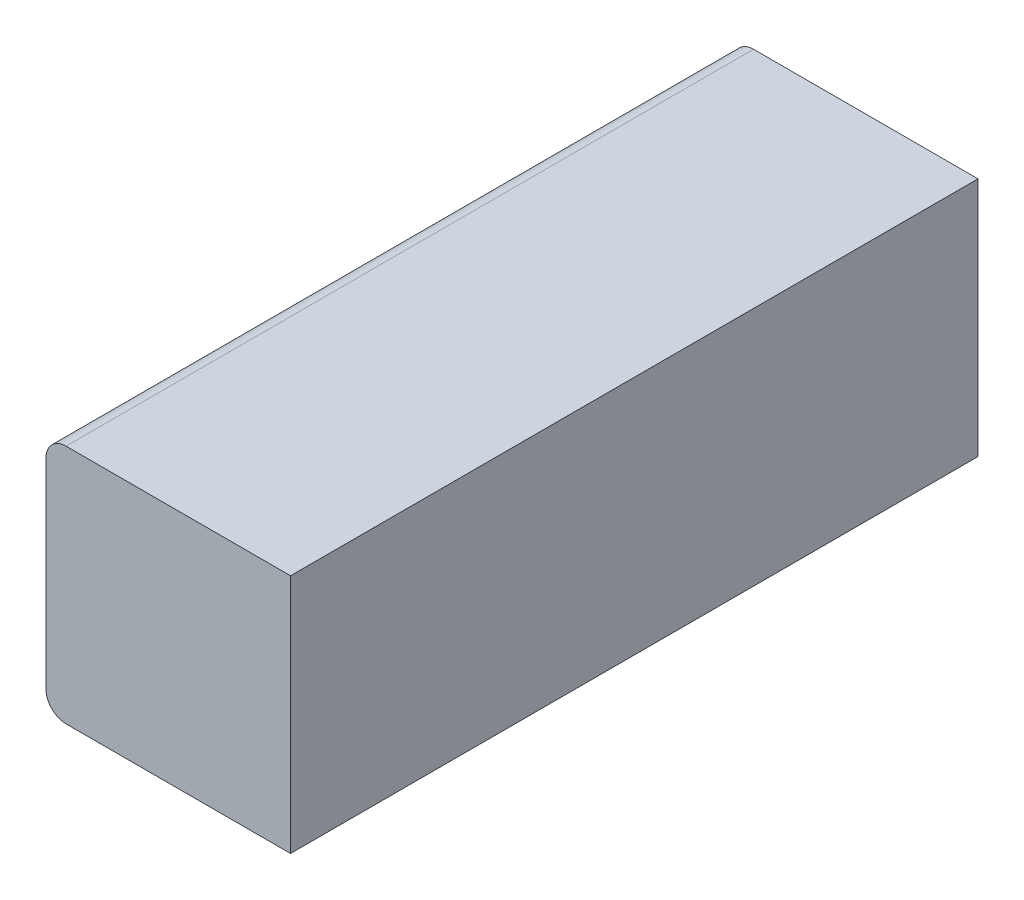
ISO-10303-21;
HEADER;
FILE_DESCRIPTION(('STEP AP214'),'2;1');
FILE_NAME('part.step','',(''),(''),'','','');
FILE_SCHEMA(('AUTOMOTIVE_DESIGN { 1 0 10303 214 1 1 1 1 }'));
ENDSEC;
DATA;
#1=APPLICATION_CONTEXT('core data for automotive mechanical design processes');
#2=APPLICATION_PROTOCOL_DEFINITION('international standard','automotive_design',2000,#1);
#3=PRODUCT_CONTEXT('',#1,'mechanical');
#4=PRODUCT('Part','Part','',(#3));
#5=PRODUCT_RELATED_PRODUCT_CATEGORY('part','',(#4));
#6=PRODUCT_DEFINITION_FORMATION('','',#4);
#7=PRODUCT_DEFINITION_CONTEXT('part definition',#1,'design');
#8=PRODUCT_DEFINITION('design','',#6,#7);
#9=PRODUCT_DEFINITION_SHAPE('','',#8);
#10=(LENGTH_UNIT() NAMED_UNIT(*) SI_UNIT(.MILLI.,.METRE.));
#11=(NAMED_UNIT(*) PLANE_ANGLE_UNIT() SI_UNIT($,.RADIAN.));
#12=(NAMED_UNIT(*) SI_UNIT($,.STERADIAN.) SOLID_ANGLE_UNIT());
#13=UNCERTAINTY_MEASURE_WITH_UNIT(LENGTH_MEASURE(1.E-05),#10,'distance_accuracy_value','');
#14=(GEOMETRIC_REPRESENTATION_CONTEXT(3) GLOBAL_UNCERTAINTY_ASSIGNED_CONTEXT((#13)) GLOBAL_UNIT_ASSIGNED_CONTEXT((#10,
#11,#12)) REPRESENTATION_CONTEXT('',''));
#15=CARTESIAN_POINT('',(0.,0.,0.));
#16=DIRECTION('',(0.,0.,1.));
#17=DIRECTION('',(1.,0.,0.));
#18=AXIS2_PLACEMENT_3D('',#15,#16,#17);
#19=CARTESIAN_POINT('',(0.,0.,1715.));
#20=DIRECTION('',(1.,0.,0.));
#21=DIRECTION('',(0.,0.,-1.));
#22=AXIS2_PLACEMENT_3D('',#19,#20,#21);
#23=PLANE('',#22);
#24=DIRECTION('',(0.,-1.,0.));
#25=VECTOR('',#24,1.);
#26=CARTESIAN_POINT('',(0.,0.,1715.));
#27=LINE('',#26,#25);
#28=CARTESIAN_POINT('',(0.,550.,1715.));
#29=VERTEX_POINT('',#28);
#30=CARTESIAN_POINT('',(0.,50.,1715.));
#31=VERTEX_POINT('',#30);
#32=EDGE_CURVE('E102',#29,#31,#27,.T.);
#33=ORIENTED_EDGE('',*,*,#32,.F.);
#34=DIRECTION('',(0.,0.,-1.));
#35=VECTOR('',#34,1.);
#36=CARTESIAN_POINT('',(0.,550.,1715.));
#37=LINE('',#36,#35);
#38=CARTESIAN_POINT('',(0.,550.,0.));
#39=VERTEX_POINT('',#38);
#40=EDGE_CURVE('E140',#29,#39,#37,.T.);
#41=ORIENTED_EDGE('',*,*,#40,.T.);
#42=DIRECTION('',(0.,-1.,0.));
#43=VECTOR('',#42,1.);
#44=CARTESIAN_POINT('',(0.,0.,0.));
#45=LINE('',#44,#43);
#46=CARTESIAN_POINT('',(0.,50.,0.));
#47=VERTEX_POINT('',#46);
#48=EDGE_CURVE('E124',#39,#47,#45,.T.);
#49=ORIENTED_EDGE('',*,*,#48,.T.);
#50=DIRECTION('',(0.,0.,-1.));
#51=VECTOR('',#50,1.);
#52=CARTESIAN_POINT('',(0.,50.,1715.));
#53=LINE('',#52,#51);
#54=EDGE_CURVE('E112',#47,#31,#53,.F.);
#55=ORIENTED_EDGE('',*,*,#54,.T.);
#56=EDGE_LOOP('',(#33,#41,#49,#55));
#57=FACE_BOUND('',#56,.T.);
#58=ADVANCED_FACE('F39',(#57),#23,.F.);
#59=CARTESIAN_POINT('',(0.,0.,1715.));
#60=DIRECTION('',(0.,1.,0.));
#61=DIRECTION('',(0.,0.,1.));
#62=AXIS2_PLACEMENT_3D('',#59,#60,#61);
#63=PLANE('',#62);
#64=DIRECTION('',(1.,0.,0.));
#65=VECTOR('',#64,1.);
#66=CARTESIAN_POINT('',(0.,0.,1715.));
#67=LINE('',#66,#65);
#68=CARTESIAN_POINT('',(50.,0.,1715.));
#69=VERTEX_POINT('',#68);
#70=CARTESIAN_POINT('',(610.,0.,1715.));
#71=VERTEX_POINT('',#70);
#72=EDGE_CURVE('E93',#69,#71,#67,.T.);
#73=ORIENTED_EDGE('',*,*,#72,.F.);
#74=DIRECTION('',(0.,0.,-1.));
#75=VECTOR('',#74,1.);
#76=CARTESIAN_POINT('',(50.,0.,1715.));
#77=LINE('',#76,#75);
#78=CARTESIAN_POINT('',(50.,0.,0.));
#79=VERTEX_POINT('',#78);
#80=EDGE_CURVE('E11',#69,#79,#77,.T.);
#81=ORIENTED_EDGE('',*,*,#80,.T.);
#82=DIRECTION('',(1.,0.,0.));
#83=VECTOR('',#82,1.);
#84=CARTESIAN_POINT('',(0.,0.,0.));
#85=LINE('',#84,#83);
#86=CARTESIAN_POINT('',(610.,0.,0.));
#87=VERTEX_POINT('',#86);
#88=EDGE_CURVE('E108',#79,#87,#85,.T.);
#89=ORIENTED_EDGE('',*,*,#88,.T.);
#90=DIRECTION('',(0.,0.,-1.));
#91=VECTOR('',#90,1.);
#92=CARTESIAN_POINT('',(610.,0.,1715.));
#93=LINE('',#92,#91);
#94=EDGE_CURVE('E105',#71,#87,#93,.T.);
#95=ORIENTED_EDGE('',*,*,#94,.F.);
#96=EDGE_LOOP('',(#73,#81,#89,#95));
#97=FACE_BOUND('',#96,.T.);
#98=ADVANCED_FACE('F106',(#97),#63,.F.);
#99=CARTESIAN_POINT('',(610.,0.,1715.));
#100=DIRECTION('',(-1.,0.,0.));
#101=DIRECTION('',(0.,0.,1.));
#102=AXIS2_PLACEMENT_3D('',#99,#100,#101);
#103=PLANE('',#102);
#104=DIRECTION('',(0.,1.,0.));
#105=VECTOR('',#104,1.);
#106=CARTESIAN_POINT('',(610.,0.,0.));
#107=LINE('',#106,#105);
#108=CARTESIAN_POINT('',(610.,600.,0.));
#109=VERTEX_POINT('',#108);
#110=EDGE_CURVE('E130',#87,#109,#107,.T.);
#111=ORIENTED_EDGE('',*,*,#110,.T.);
#112=DIRECTION('',(0.,0.,-1.));
#113=VECTOR('',#112,1.);
#114=CARTESIAN_POINT('',(610.,600.,1715.));
#115=LINE('',#114,#113);
#116=CARTESIAN_POINT('',(610.,600.,1715.));
#117=VERTEX_POINT('',#116);
#118=EDGE_CURVE('E113',#117,#109,#115,.T.);
#119=ORIENTED_EDGE('',*,*,#118,.F.);
#120=DIRECTION('',(0.,1.,0.));
#121=VECTOR('',#120,1.);
#122=CARTESIAN_POINT('',(610.,0.,1715.));
#123=LINE('',#122,#121);
#124=EDGE_CURVE('E97',#71,#117,#123,.T.);
#125=ORIENTED_EDGE('',*,*,#124,.F.);
#126=ORIENTED_EDGE('',*,*,#94,.T.);
#127=EDGE_LOOP('',(#111,#119,#125,#126));
#128=FACE_BOUND('',#127,.T.);
#129=ADVANCED_FACE('F115',(#128),#103,.F.);
#130=CARTESIAN_POINT('',(0.,600.,1715.));
#131=DIRECTION('',(0.,-1.,0.));
#132=DIRECTION('',(0.,0.,-1.));
#133=AXIS2_PLACEMENT_3D('',#130,#131,#132);
#134=PLANE('',#133);
#135=DIRECTION('',(-1.,0.,0.));
#136=VECTOR('',#135,1.);
#137=CARTESIAN_POINT('',(0.,600.,0.));
#138=LINE('',#137,#136);
#139=CARTESIAN_POINT('',(50.,600.,0.));
#140=VERTEX_POINT('',#139);
#141=EDGE_CURVE('E133',#109,#140,#138,.T.);
#142=ORIENTED_EDGE('',*,*,#141,.T.);
#143=DIRECTION('',(0.,0.,-1.));
#144=VECTOR('',#143,1.);
#145=CARTESIAN_POINT('',(50.,600.,1715.));
#146=LINE('',#145,#144);
#147=CARTESIAN_POINT('',(50.,600.,1715.));
#148=VERTEX_POINT('',#147);
#149=EDGE_CURVE('E63',#140,#148,#146,.F.);
#150=ORIENTED_EDGE('',*,*,#149,.T.);
#151=DIRECTION('',(-1.,0.,0.));
#152=VECTOR('',#151,1.);
#153=CARTESIAN_POINT('',(0.,600.,1715.));
#154=LINE('',#153,#152);
#155=EDGE_CURVE('E118',#117,#148,#154,.T.);
#156=ORIENTED_EDGE('',*,*,#155,.F.);
#157=ORIENTED_EDGE('',*,*,#118,.T.);
#158=EDGE_LOOP('',(#142,#150,#156,#157));
#159=FACE_BOUND('',#158,.T.);
#160=ADVANCED_FACE('F166',(#159),#134,.F.);
#161=CARTESIAN_POINT('',(0.,0.,1715.));
#162=DIRECTION('',(0.,0.,-1.));
#163=DIRECTION('',(-1.,0.,0.));
#164=AXIS2_PLACEMENT_3D('',#161,#162,#163);
#165=PLANE('',#164);
#166=ORIENTED_EDGE('',*,*,#155,.T.);
#167=CARTESIAN_POINT('',(50.,550.,1715.));
#168=DIRECTION('',(0.,0.,-1.));
#169=DIRECTION('',(-1.,0.,0.));
#170=AXIS2_PLACEMENT_3D('',#167,#168,#169);
#171=CIRCLE('',#170,50.);
#172=EDGE_CURVE('E48',#148,#29,#171,.F.);
#173=ORIENTED_EDGE('',*,*,#172,.T.);
#174=ORIENTED_EDGE('',*,*,#32,.T.);
#175=CARTESIAN_POINT('',(50.,50.,1715.));
#176=DIRECTION('',(0.,0.,-1.));
#177=DIRECTION('',(-1.,0.,0.));
#178=AXIS2_PLACEMENT_3D('',#175,#176,#177);
#179=CIRCLE('',#178,50.);
#180=EDGE_CURVE('E55',#31,#69,#179,.F.);
#181=ORIENTED_EDGE('',*,*,#180,.T.);
#182=ORIENTED_EDGE('',*,*,#72,.T.);
#183=ORIENTED_EDGE('',*,*,#124,.T.);
#184=EDGE_LOOP('',(#166,#173,#174,#181,#182,#183));
#185=FACE_BOUND('',#184,.T.);
#186=ADVANCED_FACE('F95',(#185),#165,.F.);
#187=CARTESIAN_POINT('',(0.,0.,0.));
#188=DIRECTION('',(0.,0.,-1.));
#189=DIRECTION('',(-1.,0.,0.));
#190=AXIS2_PLACEMENT_3D('',#187,#188,#189);
#191=PLANE('',#190);
#192=ORIENTED_EDGE('',*,*,#48,.F.);
#193=CARTESIAN_POINT('',(50.,550.,0.));
#194=DIRECTION('',(0.,0.,-1.));
#195=DIRECTION('',(-1.,0.,0.));
#196=AXIS2_PLACEMENT_3D('',#193,#194,#195);
#197=CIRCLE('',#196,50.);
#198=EDGE_CURVE('E147',#39,#140,#197,.T.);
#199=ORIENTED_EDGE('',*,*,#198,.T.);
#200=ORIENTED_EDGE('',*,*,#141,.F.);
#201=ORIENTED_EDGE('',*,*,#110,.F.);
#202=ORIENTED_EDGE('',*,*,#88,.F.);
#203=CARTESIAN_POINT('',(50.,50.,0.));
#204=DIRECTION('',(0.,0.,-1.));
#205=DIRECTION('',(-1.,0.,0.));
#206=AXIS2_PLACEMENT_3D('',#203,#204,#205);
#207=CIRCLE('',#206,50.);
#208=EDGE_CURVE('E144',#79,#47,#207,.T.);
#209=ORIENTED_EDGE('',*,*,#208,.T.);
#210=EDGE_LOOP('',(#192,#199,#200,#201,#202,#209));
#211=FACE_BOUND('',#210,.T.);
#212=ADVANCED_FACE('F165',(#211),#191,.T.);
#213=CARTESIAN_POINT('',(50.,550.,1715.));
#214=DIRECTION('',(0.,0.,-1.));
#215=DIRECTION('',(-1.,0.,0.));
#216=AXIS2_PLACEMENT_3D('',#213,#214,#215);
#217=CYLINDRICAL_SURFACE('',#216,50.);
#218=ORIENTED_EDGE('',*,*,#172,.F.);
#219=ORIENTED_EDGE('',*,*,#149,.F.);
#220=ORIENTED_EDGE('',*,*,#198,.F.);
#221=ORIENTED_EDGE('',*,*,#40,.F.);
#222=EDGE_LOOP('',(#218,#219,#220,#221));
#223=FACE_BOUND('',#222,.T.);
#224=ADVANCED_FACE('F162',(#223),#217,.T.);
#225=CARTESIAN_POINT('',(50.,50.,1715.));
#226=DIRECTION('',(0.,0.,-1.));
#227=DIRECTION('',(-1.,0.,0.));
#228=AXIS2_PLACEMENT_3D('',#225,#226,#227);
#229=CYLINDRICAL_SURFACE('',#228,50.);
#230=ORIENTED_EDGE('',*,*,#180,.F.);
#231=ORIENTED_EDGE('',*,*,#54,.F.);
#232=ORIENTED_EDGE('',*,*,#208,.F.);
#233=ORIENTED_EDGE('',*,*,#80,.F.);
#234=EDGE_LOOP('',(#230,#231,#232,#233));
#235=FACE_BOUND('',#234,.T.);
#236=ADVANCED_FACE('F41',(#235),#229,.T.);
#237=CLOSED_SHELL('',(#58,#98,#129,#160,#186,#212,#224,#236));
#238=MANIFOLD_SOLID_BREP('B2',#237);
#239=ADVANCED_BREP_SHAPE_REPRESENTATION('',(#18,#238),#14);
#240=SHAPE_DEFINITION_REPRESENTATION(#9,#239);
ENDSEC;
END-ISO-10303-21;
